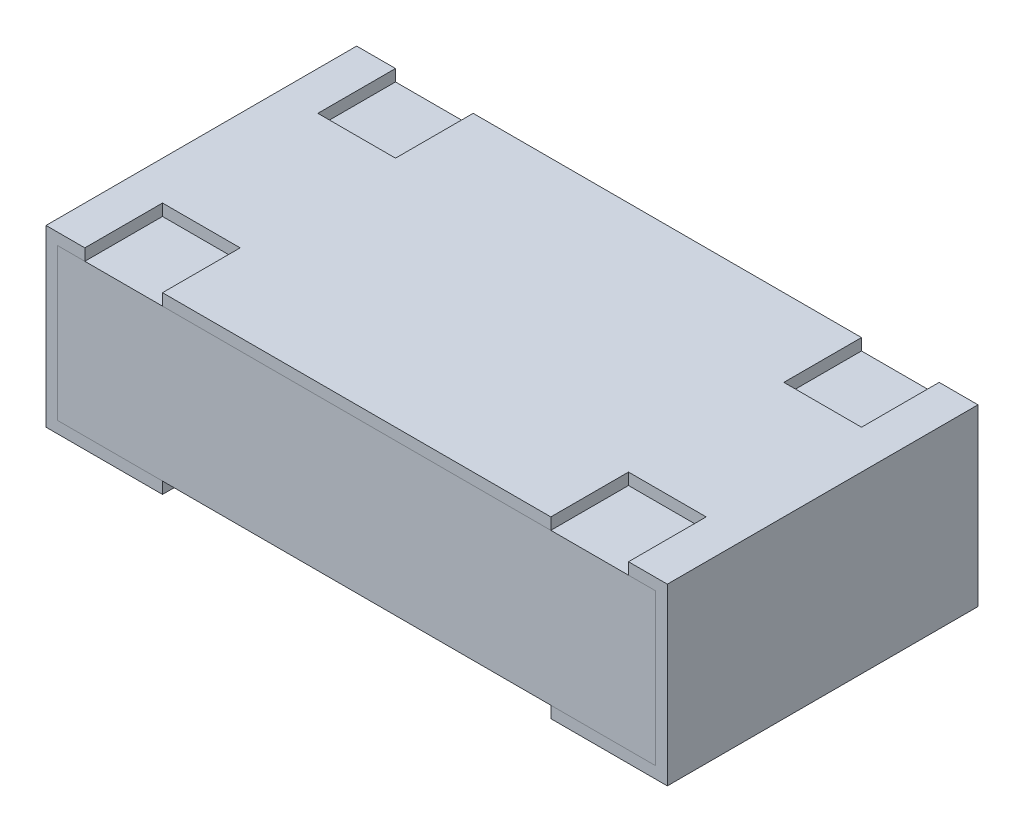
ISO-10303-21;
HEADER;
FILE_DESCRIPTION(('STEP AP214'),'2;1');
FILE_NAME('part.step','',(''),(''),'','','');
FILE_SCHEMA(('AUTOMOTIVE_DESIGN { 1 0 10303 214 1 1 1 1 }'));
ENDSEC;
DATA;
#1=APPLICATION_CONTEXT('core data for automotive mechanical design processes');
#2=APPLICATION_PROTOCOL_DEFINITION('international standard','automotive_design',2000,#1);
#3=PRODUCT_CONTEXT('',#1,'mechanical');
#4=PRODUCT('Part','Part','',(#3));
#5=PRODUCT_RELATED_PRODUCT_CATEGORY('part','',(#4));
#6=PRODUCT_DEFINITION_FORMATION('','',#4);
#7=PRODUCT_DEFINITION_CONTEXT('part definition',#1,'design');
#8=PRODUCT_DEFINITION('design','',#6,#7);
#9=PRODUCT_DEFINITION_SHAPE('','',#8);
#10=(LENGTH_UNIT() NAMED_UNIT(*) SI_UNIT(.MILLI.,.METRE.));
#11=(NAMED_UNIT(*) PLANE_ANGLE_UNIT() SI_UNIT($,.RADIAN.));
#12=(NAMED_UNIT(*) SI_UNIT($,.STERADIAN.) SOLID_ANGLE_UNIT());
#13=UNCERTAINTY_MEASURE_WITH_UNIT(LENGTH_MEASURE(1.E-05),#10,'distance_accuracy_value','');
#14=(GEOMETRIC_REPRESENTATION_CONTEXT(3) GLOBAL_UNCERTAINTY_ASSIGNED_CONTEXT((#13)) GLOBAL_UNIT_ASSIGNED_CONTEXT((#10,
#11,#12)) REPRESENTATION_CONTEXT('',''));
#15=CARTESIAN_POINT('',(0.,0.,0.));
#16=DIRECTION('',(0.,0.,1.));
#17=DIRECTION('',(1.,0.,0.));
#18=AXIS2_PLACEMENT_3D('',#15,#16,#17);
#19=CARTESIAN_POINT('',(0.77,0.42,0.));
#20=DIRECTION('',(0.,0.,1.));
#21=DIRECTION('',(1.,0.,0.));
#22=AXIS2_PLACEMENT_3D('',#19,#20,#21);
#23=PLANE('',#22);
#24=DIRECTION('',(0.,1.,0.));
#25=VECTOR('',#24,1.);
#26=CARTESIAN_POINT('',(0.77,0.03,0.));
#27=LINE('',#26,#25);
#28=CARTESIAN_POINT('',(0.77,0.03,0.));
#29=VERTEX_POINT('',#28);
#30=CARTESIAN_POINT('',(0.77,0.42,0.));
#31=VERTEX_POINT('',#30);
#32=EDGE_CURVE('P0_E89',#29,#31,#27,.T.);
#33=ORIENTED_EDGE('',*,*,#32,.F.);
#34=DIRECTION('',(1.,0.,0.));
#35=VECTOR('',#34,1.);
#36=CARTESIAN_POINT('',(0.77,0.03,0.));
#37=LINE('',#36,#35);
#38=CARTESIAN_POINT('',(-0.77,0.03,0.));
#39=VERTEX_POINT('',#38);
#40=EDGE_CURVE('P0_E26',#39,#29,#37,.T.);
#41=ORIENTED_EDGE('',*,*,#40,.F.);
#42=DIRECTION('',(0.,-1.,0.));
#43=VECTOR('',#42,1.);
#44=CARTESIAN_POINT('',(-0.77,0.03,0.));
#45=LINE('',#44,#43);
#46=CARTESIAN_POINT('',(-0.77,0.42,0.));
#47=VERTEX_POINT('',#46);
#48=EDGE_CURVE('P0_E74',#47,#39,#45,.T.);
#49=ORIENTED_EDGE('',*,*,#48,.F.);
#50=DIRECTION('',(-1.,0.,0.));
#51=VECTOR('',#50,1.);
#52=CARTESIAN_POINT('',(0.77,0.42,0.));
#53=LINE('',#52,#51);
#54=EDGE_CURVE('P0_E78',#31,#47,#53,.T.);
#55=ORIENTED_EDGE('',*,*,#54,.F.);
#56=EDGE_LOOP('',(#33,#41,#49,#55));
#57=FACE_BOUND('',#56,.T.);
#58=ADVANCED_FACE('P0_F17',(#57),#23,.F.);
#59=CARTESIAN_POINT('',(0.77,0.42,0.8));
#60=DIRECTION('',(0.,0.,1.));
#61=DIRECTION('',(1.,0.,0.));
#62=AXIS2_PLACEMENT_3D('',#59,#60,#61);
#63=PLANE('',#62);
#64=DIRECTION('',(0.,1.,0.));
#65=VECTOR('',#64,1.);
#66=CARTESIAN_POINT('',(0.77,0.03,0.8));
#67=LINE('',#66,#65);
#68=CARTESIAN_POINT('',(0.77,0.03,0.8));
#69=VERTEX_POINT('',#68);
#70=CARTESIAN_POINT('',(0.77,0.42,0.8));
#71=VERTEX_POINT('',#70);
#72=EDGE_CURVE('P0_E69',#69,#71,#67,.T.);
#73=ORIENTED_EDGE('',*,*,#72,.T.);
#74=DIRECTION('',(-1.,0.,0.));
#75=VECTOR('',#74,1.);
#76=CARTESIAN_POINT('',(0.77,0.42,0.8));
#77=LINE('',#76,#75);
#78=CARTESIAN_POINT('',(-0.77,0.42,0.8));
#79=VERTEX_POINT('',#78);
#80=EDGE_CURVE('P0_E65',#71,#79,#77,.T.);
#81=ORIENTED_EDGE('',*,*,#80,.T.);
#82=DIRECTION('',(0.,-1.,0.));
#83=VECTOR('',#82,1.);
#84=CARTESIAN_POINT('',(-0.77,0.03,0.8));
#85=LINE('',#84,#83);
#86=CARTESIAN_POINT('',(-0.77,0.03,0.8));
#87=VERTEX_POINT('',#86);
#88=EDGE_CURVE('P0_E53',#79,#87,#85,.T.);
#89=ORIENTED_EDGE('',*,*,#88,.T.);
#90=DIRECTION('',(1.,0.,0.));
#91=VECTOR('',#90,1.);
#92=CARTESIAN_POINT('',(0.77,0.03,0.8));
#93=LINE('',#92,#91);
#94=EDGE_CURVE('P0_E11',#87,#69,#93,.T.);
#95=ORIENTED_EDGE('',*,*,#94,.T.);
#96=EDGE_LOOP('',(#73,#81,#89,#95));
#97=FACE_BOUND('',#96,.T.);
#98=ADVANCED_FACE('P0_F66',(#97),#63,.T.);
#99=CARTESIAN_POINT('',(0.77,0.03,0.8));
#100=DIRECTION('',(0.,1.,0.));
#101=DIRECTION('',(1.,0.,0.));
#102=AXIS2_PLACEMENT_3D('',#99,#100,#101);
#103=PLANE('',#102);
#104=ORIENTED_EDGE('',*,*,#40,.T.);
#105=DIRECTION('',(0.,0.,-1.));
#106=VECTOR('',#105,1.);
#107=CARTESIAN_POINT('',(0.77,0.03,0.8));
#108=LINE('',#107,#106);
#109=EDGE_CURVE('P0_E85',#69,#29,#108,.T.);
#110=ORIENTED_EDGE('',*,*,#109,.F.);
#111=ORIENTED_EDGE('',*,*,#94,.F.);
#112=DIRECTION('',(0.,0.,-1.));
#113=VECTOR('',#112,1.);
#114=CARTESIAN_POINT('',(-0.77,0.03,0.8));
#115=LINE('',#114,#113);
#116=EDGE_CURVE('P0_E60',#87,#39,#115,.T.);
#117=ORIENTED_EDGE('',*,*,#116,.T.);
#118=EDGE_LOOP('',(#104,#110,#111,#117));
#119=FACE_BOUND('',#118,.T.);
#120=ADVANCED_FACE('P0_F107',(#119),#103,.F.);
#121=CARTESIAN_POINT('',(-0.77,0.03,0.8));
#122=DIRECTION('',(1.,0.,0.));
#123=DIRECTION('',(0.,1.,0.));
#124=AXIS2_PLACEMENT_3D('',#121,#122,#123);
#125=PLANE('',#124);
#126=ORIENTED_EDGE('',*,*,#48,.T.);
#127=ORIENTED_EDGE('',*,*,#116,.F.);
#128=ORIENTED_EDGE('',*,*,#88,.F.);
#129=DIRECTION('',(0.,0.,-1.));
#130=VECTOR('',#129,1.);
#131=CARTESIAN_POINT('',(-0.77,0.42,0.8));
#132=LINE('',#131,#130);
#133=EDGE_CURVE('P0_E58',#79,#47,#132,.T.);
#134=ORIENTED_EDGE('',*,*,#133,.T.);
#135=EDGE_LOOP('',(#126,#127,#128,#134));
#136=FACE_BOUND('',#135,.T.);
#137=ADVANCED_FACE('P0_F56',(#136),#125,.F.);
#138=CARTESIAN_POINT('',(0.77,0.42,0.8));
#139=DIRECTION('',(0.,-1.,0.));
#140=DIRECTION('',(0.,0.,-1.));
#141=AXIS2_PLACEMENT_3D('',#138,#139,#140);
#142=PLANE('',#141);
#143=ORIENTED_EDGE('',*,*,#54,.T.);
#144=ORIENTED_EDGE('',*,*,#133,.F.);
#145=ORIENTED_EDGE('',*,*,#80,.F.);
#146=DIRECTION('',(0.,0.,-1.));
#147=VECTOR('',#146,1.);
#148=CARTESIAN_POINT('',(0.77,0.42,0.8));
#149=LINE('',#148,#147);
#150=EDGE_CURVE('P0_E92',#71,#31,#149,.T.);
#151=ORIENTED_EDGE('',*,*,#150,.T.);
#152=EDGE_LOOP('',(#143,#144,#145,#151));
#153=FACE_BOUND('',#152,.T.);
#154=ADVANCED_FACE('P0_F76',(#153),#142,.F.);
#155=CARTESIAN_POINT('',(0.77,0.03,0.8));
#156=DIRECTION('',(-1.,0.,0.));
#157=DIRECTION('',(0.,0.,1.));
#158=AXIS2_PLACEMENT_3D('',#155,#156,#157);
#159=PLANE('',#158);
#160=ORIENTED_EDGE('',*,*,#32,.T.);
#161=ORIENTED_EDGE('',*,*,#150,.F.);
#162=ORIENTED_EDGE('',*,*,#72,.F.);
#163=ORIENTED_EDGE('',*,*,#109,.T.);
#164=EDGE_LOOP('',(#160,#161,#162,#163));
#165=FACE_BOUND('',#164,.T.);
#166=ADVANCED_FACE('P0_F129',(#165),#159,.F.);
#167=CLOSED_SHELL('',(#58,#98,#120,#137,#154,#166));
#168=MANIFOLD_SOLID_BREP('P0_B1',#167);
#169=CARTESIAN_POINT('',(0.7,0.42,0.6));
#170=DIRECTION('',(1.,0.,0.));
#171=DIRECTION('',(0.,1.,0.));
#172=AXIS2_PLACEMENT_3D('',#169,#170,#171);
#173=PLANE('',#172);
#174=DIRECTION('',(0.,0.,-1.));
#175=VECTOR('',#174,1.);
#176=CARTESIAN_POINT('',(0.7,0.45,0.6));
#177=LINE('',#176,#175);
#178=CARTESIAN_POINT('',(0.7,0.45,0.8));
#179=VERTEX_POINT('',#178);
#180=CARTESIAN_POINT('',(0.7,0.45,0.6));
#181=VERTEX_POINT('',#180);
#182=EDGE_CURVE('P1_E459',#179,#181,#177,.T.);
#183=ORIENTED_EDGE('',*,*,#182,.T.);
#184=DIRECTION('',(0.,1.,0.));
#185=VECTOR('',#184,1.);
#186=CARTESIAN_POINT('',(0.7,0.42,0.6));
#187=LINE('',#186,#185);
#188=CARTESIAN_POINT('',(0.7,0.42,0.6));
#189=VERTEX_POINT('',#188);
#190=EDGE_CURVE('P1_E11',#189,#181,#187,.T.);
#191=ORIENTED_EDGE('',*,*,#190,.F.);
#192=DIRECTION('',(0.,0.,-1.));
#193=VECTOR('',#192,1.);
#194=CARTESIAN_POINT('',(0.7,0.42,0.6));
#195=LINE('',#194,#193);
#196=CARTESIAN_POINT('',(0.7,0.42,0.8));
#197=VERTEX_POINT('',#196);
#198=EDGE_CURVE('P1_E253',#197,#189,#195,.T.);
#199=ORIENTED_EDGE('',*,*,#198,.F.);
#200=DIRECTION('',(0.,1.,0.));
#201=VECTOR('',#200,1.);
#202=CARTESIAN_POINT('',(0.7,0.42,0.8));
#203=LINE('',#202,#201);
#204=EDGE_CURVE('P1_E40',#197,#179,#203,.T.);
#205=ORIENTED_EDGE('',*,*,#204,.T.);
#206=EDGE_LOOP('',(#183,#191,#199,#205));
#207=FACE_BOUND('',#206,.T.);
#208=ADVANCED_FACE('P1_F17',(#207),#173,.F.);
#209=CARTESIAN_POINT('',(0.5,0.42,0.6));
#210=DIRECTION('',(0.,0.,-1.));
#211=DIRECTION('',(0.,-1.,0.));
#212=AXIS2_PLACEMENT_3D('',#209,#210,#211);
#213=PLANE('',#212);
#214=DIRECTION('',(-1.,0.,0.));
#215=VECTOR('',#214,1.);
#216=CARTESIAN_POINT('',(0.5,0.45,0.6));
#217=LINE('',#216,#215);
#218=CARTESIAN_POINT('',(0.5,0.45,0.6));
#219=VERTEX_POINT('',#218);
#220=EDGE_CURVE('P1_E233',#181,#219,#217,.T.);
#221=ORIENTED_EDGE('',*,*,#220,.T.);
#222=DIRECTION('',(0.,1.,0.));
#223=VECTOR('',#222,1.);
#224=CARTESIAN_POINT('',(0.5,0.42,0.6));
#225=LINE('',#224,#223);
#226=CARTESIAN_POINT('',(0.5,0.42,0.6));
#227=VERTEX_POINT('',#226);
#228=EDGE_CURVE('P1_E20',#227,#219,#225,.T.);
#229=ORIENTED_EDGE('',*,*,#228,.F.);
#230=DIRECTION('',(-1.,0.,0.));
#231=VECTOR('',#230,1.);
#232=CARTESIAN_POINT('',(0.5,0.42,0.6));
#233=LINE('',#232,#231);
#234=EDGE_CURVE('P1_E230',#189,#227,#233,.T.);
#235=ORIENTED_EDGE('',*,*,#234,.F.);
#236=ORIENTED_EDGE('',*,*,#190,.T.);
#237=EDGE_LOOP('',(#221,#229,#235,#236));
#238=FACE_BOUND('',#237,.T.);
#239=ADVANCED_FACE('P1_F228',(#238),#213,.F.);
#240=CARTESIAN_POINT('',(0.5,0.42,0.8));
#241=DIRECTION('',(-1.,0.,0.));
#242=DIRECTION('',(0.,0.,1.));
#243=AXIS2_PLACEMENT_3D('',#240,#241,#242);
#244=PLANE('',#243);
#245=DIRECTION('',(0.,0.,1.));
#246=VECTOR('',#245,1.);
#247=CARTESIAN_POINT('',(0.5,0.45,0.8));
#248=LINE('',#247,#246);
#249=CARTESIAN_POINT('',(0.5,0.45,0.8));
#250=VERTEX_POINT('',#249);
#251=EDGE_CURVE('P1_E286',#219,#250,#248,.T.);
#252=ORIENTED_EDGE('',*,*,#251,.T.);
#253=DIRECTION('',(0.,1.,0.));
#254=VECTOR('',#253,1.);
#255=CARTESIAN_POINT('',(0.5,0.42,0.8));
#256=LINE('',#255,#254);
#257=CARTESIAN_POINT('',(0.5,0.42,0.8));
#258=VERTEX_POINT('',#257);
#259=EDGE_CURVE('P1_E243',#258,#250,#256,.T.);
#260=ORIENTED_EDGE('',*,*,#259,.F.);
#261=DIRECTION('',(0.,0.,1.));
#262=VECTOR('',#261,1.);
#263=CARTESIAN_POINT('',(0.5,0.42,0.8));
#264=LINE('',#263,#262);
#265=EDGE_CURVE('P1_E240',#227,#258,#264,.T.);
#266=ORIENTED_EDGE('',*,*,#265,.F.);
#267=ORIENTED_EDGE('',*,*,#228,.T.);
#268=EDGE_LOOP('',(#252,#260,#266,#267));
#269=FACE_BOUND('',#268,.T.);
#270=ADVANCED_FACE('P1_F241',(#269),#244,.F.);
#271=CARTESIAN_POINT('',(-0.5,0.42,0.8));
#272=DIRECTION('',(1.,0.,0.));
#273=DIRECTION('',(0.,1.,0.));
#274=AXIS2_PLACEMENT_3D('',#271,#272,#273);
#275=PLANE('',#274);
#276=DIRECTION('',(0.,0.,-1.));
#277=VECTOR('',#276,1.);
#278=CARTESIAN_POINT('',(-0.5,0.45,0.8));
#279=LINE('',#278,#277);
#280=CARTESIAN_POINT('',(-0.5,0.45,0.8));
#281=VERTEX_POINT('',#280);
#282=CARTESIAN_POINT('',(-0.5,0.45,0.6));
#283=VERTEX_POINT('',#282);
#284=EDGE_CURVE('P1_E287',#281,#283,#279,.T.);
#285=ORIENTED_EDGE('',*,*,#284,.T.);
#286=DIRECTION('',(0.,1.,0.));
#287=VECTOR('',#286,1.);
#288=CARTESIAN_POINT('',(-0.5,0.42,0.6));
#289=LINE('',#288,#287);
#290=CARTESIAN_POINT('',(-0.5,0.42,0.6));
#291=VERTEX_POINT('',#290);
#292=EDGE_CURVE('P1_E238',#291,#283,#289,.T.);
#293=ORIENTED_EDGE('',*,*,#292,.F.);
#294=DIRECTION('',(0.,0.,-1.));
#295=VECTOR('',#294,1.);
#296=CARTESIAN_POINT('',(-0.5,0.42,0.8));
#297=LINE('',#296,#295);
#298=CARTESIAN_POINT('',(-0.5,0.42,0.8));
#299=VERTEX_POINT('',#298);
#300=EDGE_CURVE('P1_E248',#299,#291,#297,.T.);
#301=ORIENTED_EDGE('',*,*,#300,.F.);
#302=DIRECTION('',(0.,1.,0.));
#303=VECTOR('',#302,1.);
#304=CARTESIAN_POINT('',(-0.5,0.42,0.8));
#305=LINE('',#304,#303);
#306=EDGE_CURVE('P1_E344',#299,#281,#305,.T.);
#307=ORIENTED_EDGE('',*,*,#306,.T.);
#308=EDGE_LOOP('',(#285,#293,#301,#307));
#309=FACE_BOUND('',#308,.T.);
#310=ADVANCED_FACE('P1_F505',(#309),#275,.F.);
#311=CARTESIAN_POINT('',(-0.5,0.42,0.6));
#312=DIRECTION('',(0.,0.,-1.));
#313=DIRECTION('',(0.,-1.,0.));
#314=AXIS2_PLACEMENT_3D('',#311,#312,#313);
#315=PLANE('',#314);
#316=DIRECTION('',(-1.,0.,0.));
#317=VECTOR('',#316,1.);
#318=CARTESIAN_POINT('',(-0.5,0.45,0.6));
#319=LINE('',#318,#317);
#320=CARTESIAN_POINT('',(-0.7,0.45,0.6));
#321=VERTEX_POINT('',#320);
#322=EDGE_CURVE('P1_E316',#283,#321,#319,.T.);
#323=ORIENTED_EDGE('',*,*,#322,.T.);
#324=DIRECTION('',(0.,1.,0.));
#325=VECTOR('',#324,1.);
#326=CARTESIAN_POINT('',(-0.7,0.42,0.6));
#327=LINE('',#326,#325);
#328=CARTESIAN_POINT('',(-0.7,0.42,0.6));
#329=VERTEX_POINT('',#328);
#330=EDGE_CURVE('P1_E483',#329,#321,#327,.T.);
#331=ORIENTED_EDGE('',*,*,#330,.F.);
#332=DIRECTION('',(-1.,0.,0.));
#333=VECTOR('',#332,1.);
#334=CARTESIAN_POINT('',(-0.5,0.42,0.6));
#335=LINE('',#334,#333);
#336=EDGE_CURVE('P1_E315',#291,#329,#335,.T.);
#337=ORIENTED_EDGE('',*,*,#336,.F.);
#338=ORIENTED_EDGE('',*,*,#292,.T.);
#339=EDGE_LOOP('',(#323,#331,#337,#338));
#340=FACE_BOUND('',#339,.T.);
#341=ADVANCED_FACE('P1_F491',(#340),#315,.F.);
#342=CARTESIAN_POINT('',(-0.7,0.42,0.6));
#343=DIRECTION('',(-1.,0.,0.));
#344=DIRECTION('',(0.,0.,1.));
#345=AXIS2_PLACEMENT_3D('',#342,#343,#344);
#346=PLANE('',#345);
#347=DIRECTION('',(0.,0.,1.));
#348=VECTOR('',#347,1.);
#349=CARTESIAN_POINT('',(-0.7,0.45,0.6));
#350=LINE('',#349,#348);
#351=CARTESIAN_POINT('',(-0.7,0.45,0.8));
#352=VERTEX_POINT('',#351);
#353=EDGE_CURVE('P1_E310',#321,#352,#350,.T.);
#354=ORIENTED_EDGE('',*,*,#353,.T.);
#355=DIRECTION('',(0.,1.,0.));
#356=VECTOR('',#355,1.);
#357=CARTESIAN_POINT('',(-0.7,0.42,0.8));
#358=LINE('',#357,#356);
#359=CARTESIAN_POINT('',(-0.7,0.42,0.8));
#360=VERTEX_POINT('',#359);
#361=EDGE_CURVE('P1_E348',#360,#352,#358,.T.);
#362=ORIENTED_EDGE('',*,*,#361,.F.);
#363=DIRECTION('',(0.,0.,1.));
#364=VECTOR('',#363,1.);
#365=CARTESIAN_POINT('',(-0.7,0.42,0.6));
#366=LINE('',#365,#364);
#367=EDGE_CURVE('P1_E311',#329,#360,#366,.T.);
#368=ORIENTED_EDGE('',*,*,#367,.F.);
#369=ORIENTED_EDGE('',*,*,#330,.T.);
#370=EDGE_LOOP('',(#354,#362,#368,#369));
#371=FACE_BOUND('',#370,.T.);
#372=ADVANCED_FACE('P1_F635',(#371),#346,.F.);
#373=CARTESIAN_POINT('',(-0.7,0.42,0.2));
#374=DIRECTION('',(-1.,0.,0.));
#375=DIRECTION('',(0.,0.,1.));
#376=AXIS2_PLACEMENT_3D('',#373,#374,#375);
#377=PLANE('',#376);
#378=DIRECTION('',(0.,0.,1.));
#379=VECTOR('',#378,1.);
#380=CARTESIAN_POINT('',(-0.7,0.45,0.2));
#381=LINE('',#380,#379);
#382=CARTESIAN_POINT('',(-0.7,0.45,0.));
#383=VERTEX_POINT('',#382);
#384=CARTESIAN_POINT('',(-0.7,0.45,0.2));
#385=VERTEX_POINT('',#384);
#386=EDGE_CURVE('P1_E300',#383,#385,#381,.T.);
#387=ORIENTED_EDGE('',*,*,#386,.T.);
#388=DIRECTION('',(0.,1.,0.));
#389=VECTOR('',#388,1.);
#390=CARTESIAN_POINT('',(-0.7,0.42,0.2));
#391=LINE('',#390,#389);
#392=CARTESIAN_POINT('',(-0.7,0.42,0.2));
#393=VERTEX_POINT('',#392);
#394=EDGE_CURVE('P1_E480',#393,#385,#391,.T.);
#395=ORIENTED_EDGE('',*,*,#394,.F.);
#396=DIRECTION('',(0.,0.,1.));
#397=VECTOR('',#396,1.);
#398=CARTESIAN_POINT('',(-0.7,0.42,0.2));
#399=LINE('',#398,#397);
#400=CARTESIAN_POINT('',(-0.7,0.42,0.));
#401=VERTEX_POINT('',#400);
#402=EDGE_CURVE('P1_E367',#401,#393,#399,.T.);
#403=ORIENTED_EDGE('',*,*,#402,.F.);
#404=DIRECTION('',(0.,1.,0.));
#405=VECTOR('',#404,1.);
#406=CARTESIAN_POINT('',(-0.7,0.42,0.));
#407=LINE('',#406,#405);
#408=EDGE_CURVE('P1_E470',#401,#383,#407,.T.);
#409=ORIENTED_EDGE('',*,*,#408,.T.);
#410=EDGE_LOOP('',(#387,#395,#403,#409));
#411=FACE_BOUND('',#410,.T.);
#412=ADVANCED_FACE('P1_F646',(#411),#377,.F.);
#413=CARTESIAN_POINT('',(-0.5,0.42,0.2));
#414=DIRECTION('',(0.,0.,1.));
#415=DIRECTION('',(1.,0.,0.));
#416=AXIS2_PLACEMENT_3D('',#413,#414,#415);
#417=PLANE('',#416);
#418=DIRECTION('',(1.,0.,0.));
#419=VECTOR('',#418,1.);
#420=CARTESIAN_POINT('',(-0.5,0.45,0.2));
#421=LINE('',#420,#419);
#422=CARTESIAN_POINT('',(-0.5,0.45,0.2));
#423=VERTEX_POINT('',#422);
#424=EDGE_CURVE('P1_E290',#385,#423,#421,.T.);
#425=ORIENTED_EDGE('',*,*,#424,.T.);
#426=DIRECTION('',(0.,1.,0.));
#427=VECTOR('',#426,1.);
#428=CARTESIAN_POINT('',(-0.5,0.42,0.2));
#429=LINE('',#428,#427);
#430=CARTESIAN_POINT('',(-0.5,0.42,0.2));
#431=VERTEX_POINT('',#430);
#432=EDGE_CURVE('P1_E476',#431,#423,#429,.T.);
#433=ORIENTED_EDGE('',*,*,#432,.F.);
#434=DIRECTION('',(1.,0.,0.));
#435=VECTOR('',#434,1.);
#436=CARTESIAN_POINT('',(-0.5,0.42,0.2));
#437=LINE('',#436,#435);
#438=EDGE_CURVE('P1_E419',#393,#431,#437,.T.);
#439=ORIENTED_EDGE('',*,*,#438,.F.);
#440=ORIENTED_EDGE('',*,*,#394,.T.);
#441=EDGE_LOOP('',(#425,#433,#439,#440));
#442=FACE_BOUND('',#441,.T.);
#443=ADVANCED_FACE('P1_F655',(#442),#417,.F.);
#444=CARTESIAN_POINT('',(-0.5,0.42,0.));
#445=DIRECTION('',(1.,0.,0.));
#446=DIRECTION('',(0.,1.,0.));
#447=AXIS2_PLACEMENT_3D('',#444,#445,#446);
#448=PLANE('',#447);
#449=DIRECTION('',(0.,0.,-1.));
#450=VECTOR('',#449,1.);
#451=CARTESIAN_POINT('',(-0.5,0.45,0.));
#452=LINE('',#451,#450);
#453=CARTESIAN_POINT('',(-0.5,0.45,0.));
#454=VERTEX_POINT('',#453);
#455=EDGE_CURVE('P1_E508',#423,#454,#452,.T.);
#456=ORIENTED_EDGE('',*,*,#455,.T.);
#457=DIRECTION('',(0.,1.,0.));
#458=VECTOR('',#457,1.);
#459=CARTESIAN_POINT('',(-0.5,0.42,0.));
#460=LINE('',#459,#458);
#461=CARTESIAN_POINT('',(-0.5,0.42,0.));
#462=VERTEX_POINT('',#461);
#463=EDGE_CURVE('P1_E323',#462,#454,#460,.T.);
#464=ORIENTED_EDGE('',*,*,#463,.F.);
#465=DIRECTION('',(0.,0.,-1.));
#466=VECTOR('',#465,1.);
#467=CARTESIAN_POINT('',(-0.5,0.42,0.));
#468=LINE('',#467,#466);
#469=EDGE_CURVE('P1_E354',#431,#462,#468,.T.);
#470=ORIENTED_EDGE('',*,*,#469,.F.);
#471=ORIENTED_EDGE('',*,*,#432,.T.);
#472=EDGE_LOOP('',(#456,#464,#470,#471));
#473=FACE_BOUND('',#472,.T.);
#474=ADVANCED_FACE('P1_F660',(#473),#448,.F.);
#475=CARTESIAN_POINT('',(0.5,0.42,0.));
#476=DIRECTION('',(-1.,0.,0.));
#477=DIRECTION('',(0.,0.,1.));
#478=AXIS2_PLACEMENT_3D('',#475,#476,#477);
#479=PLANE('',#478);
#480=DIRECTION('',(0.,0.,1.));
#481=VECTOR('',#480,1.);
#482=CARTESIAN_POINT('',(0.5,0.45,0.));
#483=LINE('',#482,#481);
#484=CARTESIAN_POINT('',(0.5,0.45,0.));
#485=VERTEX_POINT('',#484);
#486=CARTESIAN_POINT('',(0.5,0.45,0.2));
#487=VERTEX_POINT('',#486);
#488=EDGE_CURVE('P1_E271',#485,#487,#483,.T.);
#489=ORIENTED_EDGE('',*,*,#488,.T.);
#490=DIRECTION('',(0.,1.,0.));
#491=VECTOR('',#490,1.);
#492=CARTESIAN_POINT('',(0.5,0.42,0.2));
#493=LINE('',#492,#491);
#494=CARTESIAN_POINT('',(0.5,0.42,0.2));
#495=VERTEX_POINT('',#494);
#496=EDGE_CURVE('P1_E475',#495,#487,#493,.T.);
#497=ORIENTED_EDGE('',*,*,#496,.F.);
#498=DIRECTION('',(0.,0.,1.));
#499=VECTOR('',#498,1.);
#500=CARTESIAN_POINT('',(0.5,0.42,0.));
#501=LINE('',#500,#499);
#502=CARTESIAN_POINT('',(0.5,0.42,0.));
#503=VERTEX_POINT('',#502);
#504=EDGE_CURVE('P1_E349',#503,#495,#501,.T.);
#505=ORIENTED_EDGE('',*,*,#504,.F.);
#506=DIRECTION('',(0.,1.,0.));
#507=VECTOR('',#506,1.);
#508=CARTESIAN_POINT('',(0.5,0.42,0.));
#509=LINE('',#508,#507);
#510=EDGE_CURVE('P1_E320',#503,#485,#509,.T.);
#511=ORIENTED_EDGE('',*,*,#510,.T.);
#512=EDGE_LOOP('',(#489,#497,#505,#511));
#513=FACE_BOUND('',#512,.T.);
#514=ADVANCED_FACE('P1_F672',(#513),#479,.F.);
#515=CARTESIAN_POINT('',(0.5,0.42,0.2));
#516=DIRECTION('',(0.,0.,1.));
#517=DIRECTION('',(1.,0.,0.));
#518=AXIS2_PLACEMENT_3D('',#515,#516,#517);
#519=PLANE('',#518);
#520=DIRECTION('',(1.,0.,0.));
#521=VECTOR('',#520,1.);
#522=CARTESIAN_POINT('',(0.5,0.45,0.2));
#523=LINE('',#522,#521);
#524=CARTESIAN_POINT('',(0.7,0.45,0.2));
#525=VERTEX_POINT('',#524);
#526=EDGE_CURVE('P1_E453',#487,#525,#523,.T.);
#527=ORIENTED_EDGE('',*,*,#526,.T.);
#528=DIRECTION('',(0.,1.,0.));
#529=VECTOR('',#528,1.);
#530=CARTESIAN_POINT('',(0.7,0.42,0.2));
#531=LINE('',#530,#529);
#532=CARTESIAN_POINT('',(0.7,0.42,0.2));
#533=VERTEX_POINT('',#532);
#534=EDGE_CURVE('P1_E471',#533,#525,#531,.T.);
#535=ORIENTED_EDGE('',*,*,#534,.F.);
#536=DIRECTION('',(1.,0.,0.));
#537=VECTOR('',#536,1.);
#538=CARTESIAN_POINT('',(0.5,0.42,0.2));
#539=LINE('',#538,#537);
#540=EDGE_CURVE('P1_E353',#495,#533,#539,.T.);
#541=ORIENTED_EDGE('',*,*,#540,.F.);
#542=ORIENTED_EDGE('',*,*,#496,.T.);
#543=EDGE_LOOP('',(#527,#535,#541,#542));
#544=FACE_BOUND('',#543,.T.);
#545=ADVANCED_FACE('P1_F684',(#544),#519,.F.);
#546=CARTESIAN_POINT('',(0.7,0.42,0.2));
#547=DIRECTION('',(1.,0.,0.));
#548=DIRECTION('',(0.,1.,0.));
#549=AXIS2_PLACEMENT_3D('',#546,#547,#548);
#550=PLANE('',#549);
#551=DIRECTION('',(0.,0.,-1.));
#552=VECTOR('',#551,1.);
#553=CARTESIAN_POINT('',(0.7,0.45,0.2));
#554=LINE('',#553,#552);
#555=CARTESIAN_POINT('',(0.7,0.45,0.));
#556=VERTEX_POINT('',#555);
#557=EDGE_CURVE('P1_E465',#525,#556,#554,.T.);
#558=ORIENTED_EDGE('',*,*,#557,.T.);
#559=DIRECTION('',(0.,1.,0.));
#560=VECTOR('',#559,1.);
#561=CARTESIAN_POINT('',(0.7,0.42,0.));
#562=LINE('',#561,#560);
#563=CARTESIAN_POINT('',(0.7,0.42,0.));
#564=VERTEX_POINT('',#563);
#565=EDGE_CURVE('P1_E291',#564,#556,#562,.T.);
#566=ORIENTED_EDGE('',*,*,#565,.F.);
#567=DIRECTION('',(0.,0.,-1.));
#568=VECTOR('',#567,1.);
#569=CARTESIAN_POINT('',(0.7,0.42,0.2));
#570=LINE('',#569,#568);
#571=EDGE_CURVE('P1_E422',#533,#564,#570,.T.);
#572=ORIENTED_EDGE('',*,*,#571,.F.);
#573=ORIENTED_EDGE('',*,*,#534,.T.);
#574=EDGE_LOOP('',(#558,#566,#572,#573));
#575=FACE_BOUND('',#574,.T.);
#576=ADVANCED_FACE('P1_F696',(#575),#550,.F.);
#577=CARTESIAN_POINT('',(-0.8,0.45,0.));
#578=DIRECTION('',(0.,0.,1.));
#579=DIRECTION('',(1.,0.,0.));
#580=AXIS2_PLACEMENT_3D('',#577,#578,#579);
#581=PLANE('',#580);
#582=DIRECTION('',(-1.,0.,0.));
#583=VECTOR('',#582,1.);
#584=CARTESIAN_POINT('',(0.,0.45,0.));
#585=LINE('',#584,#583);
#586=CARTESIAN_POINT('',(-0.8,0.45,0.));
#587=VERTEX_POINT('',#586);
#588=EDGE_CURVE('P1_E281',#383,#587,#585,.T.);
#589=ORIENTED_EDGE('',*,*,#588,.F.);
#590=ORIENTED_EDGE('',*,*,#408,.F.);
#591=DIRECTION('',(1.,0.,0.));
#592=VECTOR('',#591,1.);
#593=CARTESIAN_POINT('',(0.,0.42,0.));
#594=LINE('',#593,#592);
#595=CARTESIAN_POINT('',(-0.77,0.42,0.));
#596=VERTEX_POINT('',#595);
#597=EDGE_CURVE('P1_E314',#596,#401,#594,.T.);
#598=ORIENTED_EDGE('',*,*,#597,.F.);
#599=DIRECTION('',(0.,1.,0.));
#600=VECTOR('',#599,1.);
#601=CARTESIAN_POINT('',(-0.77,0.42,0.));
#602=LINE('',#601,#600);
#603=CARTESIAN_POINT('',(-0.77,0.03,0.));
#604=VERTEX_POINT('',#603);
#605=EDGE_CURVE('P1_E414',#604,#596,#602,.T.);
#606=ORIENTED_EDGE('',*,*,#605,.F.);
#607=DIRECTION('',(-1.,0.,0.));
#608=VECTOR('',#607,1.);
#609=CARTESIAN_POINT('',(-0.77,0.03,0.));
#610=LINE('',#609,#608);
#611=CARTESIAN_POINT('',(-0.5,0.03,0.));
#612=VERTEX_POINT('',#611);
#613=EDGE_CURVE('P1_E409',#612,#604,#610,.T.);
#614=ORIENTED_EDGE('',*,*,#613,.F.);
#615=DIRECTION('',(0.,1.,0.));
#616=VECTOR('',#615,1.);
#617=CARTESIAN_POINT('',(-0.5,0.03,0.));
#618=LINE('',#617,#616);
#619=CARTESIAN_POINT('',(-0.5,0.,0.));
#620=VERTEX_POINT('',#619);
#621=EDGE_CURVE('P1_E340',#620,#612,#618,.T.);
#622=ORIENTED_EDGE('',*,*,#621,.F.);
#623=DIRECTION('',(1.,0.,0.));
#624=VECTOR('',#623,1.);
#625=CARTESIAN_POINT('',(-0.8,0.,0.));
#626=LINE('',#625,#624);
#627=CARTESIAN_POINT('',(-0.8,0.,0.));
#628=VERTEX_POINT('',#627);
#629=EDGE_CURVE('P1_E341',#628,#620,#626,.T.);
#630=ORIENTED_EDGE('',*,*,#629,.F.);
#631=DIRECTION('',(0.,-1.,0.));
#632=VECTOR('',#631,1.);
#633=CARTESIAN_POINT('',(-0.8,0.45,0.));
#634=LINE('',#633,#632);
#635=EDGE_CURVE('P1_E398',#587,#628,#634,.T.);
#636=ORIENTED_EDGE('',*,*,#635,.F.);
#637=EDGE_LOOP('',(#589,#590,#598,#606,#614,#622,#630,#636));
#638=FACE_BOUND('',#637,.T.);
#639=ADVANCED_FACE('P1_F705',(#638),#581,.F.);
#640=CARTESIAN_POINT('',(-0.8,0.45,0.8));
#641=DIRECTION('',(0.,0.,1.));
#642=DIRECTION('',(1.,0.,0.));
#643=AXIS2_PLACEMENT_3D('',#640,#641,#642);
#644=PLANE('',#643);
#645=ORIENTED_EDGE('',*,*,#204,.F.);
#646=DIRECTION('',(1.,0.,0.));
#647=VECTOR('',#646,1.);
#648=CARTESIAN_POINT('',(0.,0.42,0.8));
#649=LINE('',#648,#647);
#650=CARTESIAN_POINT('',(0.77,0.42,0.8));
#651=VERTEX_POINT('',#650);
#652=EDGE_CURVE('P1_E260',#197,#651,#649,.T.);
#653=ORIENTED_EDGE('',*,*,#652,.T.);
#654=DIRECTION('',(0.,-1.,0.));
#655=VECTOR('',#654,1.);
#656=CARTESIAN_POINT('',(0.77,0.42,0.8));
#657=LINE('',#656,#655);
#658=CARTESIAN_POINT('',(0.77,0.03,0.8));
#659=VERTEX_POINT('',#658);
#660=EDGE_CURVE('P1_E430',#651,#659,#657,.T.);
#661=ORIENTED_EDGE('',*,*,#660,.T.);
#662=DIRECTION('',(-1.,0.,0.));
#663=VECTOR('',#662,1.);
#664=CARTESIAN_POINT('',(0.77,0.03,0.8));
#665=LINE('',#664,#663);
#666=CARTESIAN_POINT('',(0.5,0.03,0.8));
#667=VERTEX_POINT('',#666);
#668=EDGE_CURVE('P1_E383',#659,#667,#665,.T.);
#669=ORIENTED_EDGE('',*,*,#668,.T.);
#670=DIRECTION('',(0.,-1.,0.));
#671=VECTOR('',#670,1.);
#672=CARTESIAN_POINT('',(0.5,0.03,0.8));
#673=LINE('',#672,#671);
#674=CARTESIAN_POINT('',(0.5,0.,0.8));
#675=VERTEX_POINT('',#674);
#676=EDGE_CURVE('P1_E270',#667,#675,#673,.T.);
#677=ORIENTED_EDGE('',*,*,#676,.T.);
#678=DIRECTION('',(1.,0.,0.));
#679=VECTOR('',#678,1.);
#680=CARTESIAN_POINT('',(0.8,0.,0.8));
#681=LINE('',#680,#679);
#682=CARTESIAN_POINT('',(0.8,0.,0.8));
#683=VERTEX_POINT('',#682);
#684=EDGE_CURVE('P1_E269',#675,#683,#681,.T.);
#685=ORIENTED_EDGE('',*,*,#684,.T.);
#686=DIRECTION('',(0.,1.,0.));
#687=VECTOR('',#686,1.);
#688=CARTESIAN_POINT('',(0.8,0.45,0.8));
#689=LINE('',#688,#687);
#690=CARTESIAN_POINT('',(0.8,0.45,0.8));
#691=VERTEX_POINT('',#690);
#692=EDGE_CURVE('P1_E449',#683,#691,#689,.T.);
#693=ORIENTED_EDGE('',*,*,#692,.T.);
#694=DIRECTION('',(-1.,0.,0.));
#695=VECTOR('',#694,1.);
#696=CARTESIAN_POINT('',(0.,0.45,0.8));
#697=LINE('',#696,#695);
#698=EDGE_CURVE('P1_E462',#691,#179,#697,.T.);
#699=ORIENTED_EDGE('',*,*,#698,.T.);
#700=EDGE_LOOP('',(#645,#653,#661,#669,#677,#685,#693,#699));
#701=FACE_BOUND('',#700,.T.);
#702=ADVANCED_FACE('P1_F551',(#701),#644,.T.);
#703=CARTESIAN_POINT('',(0.8,0.45,0.8));
#704=DIRECTION('',(-1.,0.,0.));
#705=DIRECTION('',(0.,0.,1.));
#706=AXIS2_PLACEMENT_3D('',#703,#704,#705);
#707=PLANE('',#706);
#708=DIRECTION('',(0.,1.,0.));
#709=VECTOR('',#708,1.);
#710=CARTESIAN_POINT('',(0.8,0.45,0.));
#711=LINE('',#710,#709);
#712=CARTESIAN_POINT('',(0.8,0.,0.));
#713=VERTEX_POINT('',#712);
#714=CARTESIAN_POINT('',(0.8,0.45,0.));
#715=VERTEX_POINT('',#714);
#716=EDGE_CURVE('P1_E387',#713,#715,#711,.T.);
#717=ORIENTED_EDGE('',*,*,#716,.T.);
#718=DIRECTION('',(0.,0.,-1.));
#719=VECTOR('',#718,1.);
#720=CARTESIAN_POINT('',(0.8,0.45,0.8));
#721=LINE('',#720,#719);
#722=EDGE_CURVE('P1_E446',#691,#715,#721,.T.);
#723=ORIENTED_EDGE('',*,*,#722,.F.);
#724=ORIENTED_EDGE('',*,*,#692,.F.);
#725=DIRECTION('',(0.,0.,-1.));
#726=VECTOR('',#725,1.);
#727=CARTESIAN_POINT('',(0.8,0.,0.8));
#728=LINE('',#727,#726);
#729=EDGE_CURVE('P1_E266',#683,#713,#728,.T.);
#730=ORIENTED_EDGE('',*,*,#729,.T.);
#731=EDGE_LOOP('',(#717,#723,#724,#730));
#732=FACE_BOUND('',#731,.T.);
#733=ADVANCED_FACE('P1_F539',(#732),#707,.F.);
#734=CARTESIAN_POINT('',(0.8,0.,0.8));
#735=DIRECTION('',(0.,1.,0.));
#736=DIRECTION('',(1.,0.,0.));
#737=AXIS2_PLACEMENT_3D('',#734,#735,#736);
#738=PLANE('',#737);
#739=DIRECTION('',(1.,0.,0.));
#740=VECTOR('',#739,1.);
#741=CARTESIAN_POINT('',(0.8,0.,0.));
#742=LINE('',#741,#740);
#743=CARTESIAN_POINT('',(0.5,0.,0.));
#744=VERTEX_POINT('',#743);
#745=EDGE_CURVE('P1_E329',#744,#713,#742,.T.);
#746=ORIENTED_EDGE('',*,*,#745,.T.);
#747=ORIENTED_EDGE('',*,*,#729,.F.);
#748=ORIENTED_EDGE('',*,*,#684,.F.);
#749=DIRECTION('',(0.,0.,-1.));
#750=VECTOR('',#749,1.);
#751=CARTESIAN_POINT('',(0.5,0.,0.8));
#752=LINE('',#751,#750);
#753=EDGE_CURVE('P1_E380',#675,#744,#752,.T.);
#754=ORIENTED_EDGE('',*,*,#753,.T.);
#755=EDGE_LOOP('',(#746,#747,#748,#754));
#756=FACE_BOUND('',#755,.T.);
#757=ADVANCED_FACE('P1_F722',(#756),#738,.F.);
#758=CARTESIAN_POINT('',(0.5,0.03,0.8));
#759=DIRECTION('',(1.,0.,0.));
#760=DIRECTION('',(0.,1.,0.));
#761=AXIS2_PLACEMENT_3D('',#758,#759,#760);
#762=PLANE('',#761);
#763=DIRECTION('',(0.,-1.,0.));
#764=VECTOR('',#763,1.);
#765=CARTESIAN_POINT('',(0.5,0.03,0.));
#766=LINE('',#765,#764);
#767=CARTESIAN_POINT('',(0.5,0.03,0.));
#768=VERTEX_POINT('',#767);
#769=EDGE_CURVE('P1_E324',#768,#744,#766,.T.);
#770=ORIENTED_EDGE('',*,*,#769,.T.);
#771=ORIENTED_EDGE('',*,*,#753,.F.);
#772=ORIENTED_EDGE('',*,*,#676,.F.);
#773=DIRECTION('',(0.,0.,-1.));
#774=VECTOR('',#773,1.);
#775=CARTESIAN_POINT('',(0.5,0.03,0.8));
#776=LINE('',#775,#774);
#777=EDGE_CURVE('P1_E434',#667,#768,#776,.T.);
#778=ORIENTED_EDGE('',*,*,#777,.T.);
#779=EDGE_LOOP('',(#770,#771,#772,#778));
#780=FACE_BOUND('',#779,.T.);
#781=ADVANCED_FACE('P1_F730',(#780),#762,.F.);
#782=CARTESIAN_POINT('',(0.77,0.03,0.8));
#783=DIRECTION('',(0.,-1.,0.));
#784=DIRECTION('',(0.,0.,-1.));
#785=AXIS2_PLACEMENT_3D('',#782,#783,#784);
#786=PLANE('',#785);
#787=DIRECTION('',(-1.,0.,0.));
#788=VECTOR('',#787,1.);
#789=CARTESIAN_POINT('',(0.77,0.03,0.));
#790=LINE('',#789,#788);
#791=CARTESIAN_POINT('',(0.77,0.03,0.));
#792=VERTEX_POINT('',#791);
#793=EDGE_CURVE('P1_E328',#792,#768,#790,.T.);
#794=ORIENTED_EDGE('',*,*,#793,.T.);
#795=ORIENTED_EDGE('',*,*,#777,.F.);
#796=ORIENTED_EDGE('',*,*,#668,.F.);
#797=DIRECTION('',(0.,0.,-1.));
#798=VECTOR('',#797,1.);
#799=CARTESIAN_POINT('',(0.77,0.03,0.8));
#800=LINE('',#799,#798);
#801=EDGE_CURVE('P1_E429',#659,#792,#800,.T.);
#802=ORIENTED_EDGE('',*,*,#801,.T.);
#803=EDGE_LOOP('',(#794,#795,#796,#802));
#804=FACE_BOUND('',#803,.T.);
#805=ADVANCED_FACE('P1_F735',(#804),#786,.F.);
#806=CARTESIAN_POINT('',(0.77,0.42,0.8));
#807=DIRECTION('',(1.,0.,0.));
#808=DIRECTION('',(0.,1.,0.));
#809=AXIS2_PLACEMENT_3D('',#806,#807,#808);
#810=PLANE('',#809);
#811=DIRECTION('',(0.,-1.,0.));
#812=VECTOR('',#811,1.);
#813=CARTESIAN_POINT('',(0.77,0.42,0.));
#814=LINE('',#813,#812);
#815=CARTESIAN_POINT('',(0.77,0.42,0.));
#816=VERTEX_POINT('',#815);
#817=EDGE_CURVE('P1_E394',#816,#792,#814,.T.);
#818=ORIENTED_EDGE('',*,*,#817,.T.);
#819=ORIENTED_EDGE('',*,*,#801,.F.);
#820=ORIENTED_EDGE('',*,*,#660,.F.);
#821=DIRECTION('',(0.,0.,-1.));
#822=VECTOR('',#821,1.);
#823=CARTESIAN_POINT('',(0.77,0.42,0.8));
#824=LINE('',#823,#822);
#825=EDGE_CURVE('P1_E425',#651,#816,#824,.T.);
#826=ORIENTED_EDGE('',*,*,#825,.T.);
#827=EDGE_LOOP('',(#818,#819,#820,#826));
#828=FACE_BOUND('',#827,.T.);
#829=ADVANCED_FACE('P1_F744',(#828),#810,.F.);
#830=CARTESIAN_POINT('',(0.,0.42,0.8));
#831=DIRECTION('',(0.,1.,0.));
#832=DIRECTION('',(1.,0.,0.));
#833=AXIS2_PLACEMENT_3D('',#830,#831,#832);
#834=PLANE('',#833);
#835=ORIENTED_EDGE('',*,*,#438,.T.);
#836=ORIENTED_EDGE('',*,*,#469,.T.);
#837=DIRECTION('',(1.,0.,0.));
#838=VECTOR('',#837,1.);
#839=CARTESIAN_POINT('',(0.,0.42,0.));
#840=LINE('',#839,#838);
#841=EDGE_CURVE('P1_E371',#462,#503,#840,.T.);
#842=ORIENTED_EDGE('',*,*,#841,.T.);
#843=ORIENTED_EDGE('',*,*,#504,.T.);
#844=ORIENTED_EDGE('',*,*,#540,.T.);
#845=ORIENTED_EDGE('',*,*,#571,.T.);
#846=DIRECTION('',(1.,0.,0.));
#847=VECTOR('',#846,1.);
#848=CARTESIAN_POINT('',(0.,0.42,0.));
#849=LINE('',#848,#847);
#850=EDGE_CURVE('P1_E296',#564,#816,#849,.T.);
#851=ORIENTED_EDGE('',*,*,#850,.T.);
#852=ORIENTED_EDGE('',*,*,#825,.F.);
#853=ORIENTED_EDGE('',*,*,#652,.F.);
#854=ORIENTED_EDGE('',*,*,#198,.T.);
#855=ORIENTED_EDGE('',*,*,#234,.T.);
#856=ORIENTED_EDGE('',*,*,#265,.T.);
#857=DIRECTION('',(1.,0.,0.));
#858=VECTOR('',#857,1.);
#859=CARTESIAN_POINT('',(0.,0.42,0.8));
#860=LINE('',#859,#858);
#861=EDGE_CURVE('P1_E345',#299,#258,#860,.T.);
#862=ORIENTED_EDGE('',*,*,#861,.F.);
#863=ORIENTED_EDGE('',*,*,#300,.T.);
#864=ORIENTED_EDGE('',*,*,#336,.T.);
#865=ORIENTED_EDGE('',*,*,#367,.T.);
#866=DIRECTION('',(1.,0.,0.));
#867=VECTOR('',#866,1.);
#868=CARTESIAN_POINT('',(0.,0.42,0.8));
#869=LINE('',#868,#867);
#870=CARTESIAN_POINT('',(-0.77,0.42,0.8));
#871=VERTEX_POINT('',#870);
#872=EDGE_CURVE('P1_E334',#871,#360,#869,.T.);
#873=ORIENTED_EDGE('',*,*,#872,.F.);
#874=DIRECTION('',(0.,0.,-1.));
#875=VECTOR('',#874,1.);
#876=CARTESIAN_POINT('',(-0.77,0.42,0.8));
#877=LINE('',#876,#875);
#878=EDGE_CURVE('P1_E418',#871,#596,#877,.T.);
#879=ORIENTED_EDGE('',*,*,#878,.T.);
#880=ORIENTED_EDGE('',*,*,#597,.T.);
#881=ORIENTED_EDGE('',*,*,#402,.T.);
#882=EDGE_LOOP('',(#835,#836,#842,#843,#844,#845,#851,#852,#853,#854,#855,#856,#862,#863,#864,
#865,#873,#879,#880,#881));
#883=FACE_BOUND('',#882,.T.);
#884=ADVANCED_FACE('P1_F251',(#883),#834,.F.);
#885=CARTESIAN_POINT('',(-0.77,0.42,0.8));
#886=DIRECTION('',(-1.,0.,0.));
#887=DIRECTION('',(0.,0.,1.));
#888=AXIS2_PLACEMENT_3D('',#885,#886,#887);
#889=PLANE('',#888);
#890=ORIENTED_EDGE('',*,*,#605,.T.);
#891=ORIENTED_EDGE('',*,*,#878,.F.);
#892=DIRECTION('',(0.,1.,0.));
#893=VECTOR('',#892,1.);
#894=CARTESIAN_POINT('',(-0.77,0.42,0.8));
#895=LINE('',#894,#893);
#896=CARTESIAN_POINT('',(-0.77,0.03,0.8));
#897=VERTEX_POINT('',#896);
#898=EDGE_CURVE('P1_E330',#897,#871,#895,.T.);
#899=ORIENTED_EDGE('',*,*,#898,.F.);
#900=DIRECTION('',(0.,0.,-1.));
#901=VECTOR('',#900,1.);
#902=CARTESIAN_POINT('',(-0.77,0.03,0.8));
#903=LINE('',#902,#901);
#904=EDGE_CURVE('P1_E413',#897,#604,#903,.T.);
#905=ORIENTED_EDGE('',*,*,#904,.T.);
#906=EDGE_LOOP('',(#890,#891,#899,#905));
#907=FACE_BOUND('',#906,.T.);
#908=ADVANCED_FACE('P1_F750',(#907),#889,.F.);
#909=CARTESIAN_POINT('',(-0.77,0.03,0.8));
#910=DIRECTION('',(0.,-1.,0.));
#911=DIRECTION('',(0.,0.,-1.));
#912=AXIS2_PLACEMENT_3D('',#909,#910,#911);
#913=PLANE('',#912);
#914=ORIENTED_EDGE('',*,*,#613,.T.);
#915=ORIENTED_EDGE('',*,*,#904,.F.);
#916=DIRECTION('',(-1.,0.,0.));
#917=VECTOR('',#916,1.);
#918=CARTESIAN_POINT('',(-0.77,0.03,0.8));
#919=LINE('',#918,#917);
#920=CARTESIAN_POINT('',(-0.5,0.03,0.8));
#921=VERTEX_POINT('',#920);
#922=EDGE_CURVE('P1_E335',#921,#897,#919,.T.);
#923=ORIENTED_EDGE('',*,*,#922,.F.);
#924=DIRECTION('',(0.,0.,-1.));
#925=VECTOR('',#924,1.);
#926=CARTESIAN_POINT('',(-0.5,0.03,0.8));
#927=LINE('',#926,#925);
#928=EDGE_CURVE('P1_E408',#921,#612,#927,.T.);
#929=ORIENTED_EDGE('',*,*,#928,.T.);
#930=EDGE_LOOP('',(#914,#915,#923,#929));
#931=FACE_BOUND('',#930,.T.);
#932=ADVANCED_FACE('P1_F755',(#931),#913,.F.);
#933=CARTESIAN_POINT('',(-0.5,0.03,0.8));
#934=DIRECTION('',(-1.,0.,0.));
#935=DIRECTION('',(0.,0.,1.));
#936=AXIS2_PLACEMENT_3D('',#933,#934,#935);
#937=PLANE('',#936);
#938=ORIENTED_EDGE('',*,*,#621,.T.);
#939=ORIENTED_EDGE('',*,*,#928,.F.);
#940=DIRECTION('',(0.,1.,0.));
#941=VECTOR('',#940,1.);
#942=CARTESIAN_POINT('',(-0.5,0.03,0.8));
#943=LINE('',#942,#941);
#944=CARTESIAN_POINT('',(-0.5,0.,0.8));
#945=VERTEX_POINT('',#944);
#946=EDGE_CURVE('P1_E359',#945,#921,#943,.T.);
#947=ORIENTED_EDGE('',*,*,#946,.F.);
#948=DIRECTION('',(0.,0.,-1.));
#949=VECTOR('',#948,1.);
#950=CARTESIAN_POINT('',(-0.5,0.,0.8));
#951=LINE('',#950,#949);
#952=EDGE_CURVE('P1_E336',#945,#620,#951,.T.);
#953=ORIENTED_EDGE('',*,*,#952,.T.);
#954=EDGE_LOOP('',(#938,#939,#947,#953));
#955=FACE_BOUND('',#954,.T.);
#956=ADVANCED_FACE('P1_F765',(#955),#937,.F.);
#957=CARTESIAN_POINT('',(-0.8,0.,0.8));
#958=DIRECTION('',(0.,1.,0.));
#959=DIRECTION('',(1.,0.,0.));
#960=AXIS2_PLACEMENT_3D('',#957,#958,#959);
#961=PLANE('',#960);
#962=ORIENTED_EDGE('',*,*,#629,.T.);
#963=ORIENTED_EDGE('',*,*,#952,.F.);
#964=DIRECTION('',(1.,0.,0.));
#965=VECTOR('',#964,1.);
#966=CARTESIAN_POINT('',(-0.8,0.,0.8));
#967=LINE('',#966,#965);
#968=CARTESIAN_POINT('',(-0.8,0.,0.8));
#969=VERTEX_POINT('',#968);
#970=EDGE_CURVE('P1_E355',#969,#945,#967,.T.);
#971=ORIENTED_EDGE('',*,*,#970,.F.);
#972=DIRECTION('',(0.,0.,-1.));
#973=VECTOR('',#972,1.);
#974=CARTESIAN_POINT('',(-0.8,0.,0.8));
#975=LINE('',#974,#973);
#976=EDGE_CURVE('P1_E264',#969,#628,#975,.T.);
#977=ORIENTED_EDGE('',*,*,#976,.T.);
#978=EDGE_LOOP('',(#962,#963,#971,#977));
#979=FACE_BOUND('',#978,.T.);
#980=ADVANCED_FACE('P1_F784',(#979),#961,.F.);
#981=CARTESIAN_POINT('',(-0.8,0.45,0.8));
#982=DIRECTION('',(1.,0.,0.));
#983=DIRECTION('',(0.,1.,0.));
#984=AXIS2_PLACEMENT_3D('',#981,#982,#983);
#985=PLANE('',#984);
#986=ORIENTED_EDGE('',*,*,#635,.T.);
#987=ORIENTED_EDGE('',*,*,#976,.F.);
#988=DIRECTION('',(0.,-1.,0.));
#989=VECTOR('',#988,1.);
#990=CARTESIAN_POINT('',(-0.8,0.45,0.8));
#991=LINE('',#990,#989);
#992=CARTESIAN_POINT('',(-0.8,0.45,0.8));
#993=VERTEX_POINT('',#992);
#994=EDGE_CURVE('P1_E360',#993,#969,#991,.T.);
#995=ORIENTED_EDGE('',*,*,#994,.F.);
#996=DIRECTION('',(0.,0.,-1.));
#997=VECTOR('',#996,1.);
#998=CARTESIAN_POINT('',(-0.8,0.45,0.8));
#999=LINE('',#998,#997);
#1000=EDGE_CURVE('P1_E276',#993,#587,#999,.T.);
#1001=ORIENTED_EDGE('',*,*,#1000,.T.);
#1002=EDGE_LOOP('',(#986,#987,#995,#1001));
#1003=FACE_BOUND('',#1002,.T.);
#1004=ADVANCED_FACE('P1_F806',(#1003),#985,.F.);
#1005=CARTESIAN_POINT('',(-0.8,0.45,0.));
#1006=DIRECTION('',(0.,0.,1.));
#1007=DIRECTION('',(1.,0.,0.));
#1008=AXIS2_PLACEMENT_3D('',#1005,#1006,#1007);
#1009=PLANE('',#1008);
#1010=ORIENTED_EDGE('',*,*,#850,.F.);
#1011=ORIENTED_EDGE('',*,*,#565,.T.);
#1012=DIRECTION('',(-1.,0.,0.));
#1013=VECTOR('',#1012,1.);
#1014=CARTESIAN_POINT('',(0.,0.45,0.));
#1015=LINE('',#1014,#1013);
#1016=EDGE_CURVE('P1_E295',#715,#556,#1015,.T.);
#1017=ORIENTED_EDGE('',*,*,#1016,.F.);
#1018=ORIENTED_EDGE('',*,*,#716,.F.);
#1019=ORIENTED_EDGE('',*,*,#745,.F.);
#1020=ORIENTED_EDGE('',*,*,#769,.F.);
#1021=ORIENTED_EDGE('',*,*,#793,.F.);
#1022=ORIENTED_EDGE('',*,*,#817,.F.);
#1023=EDGE_LOOP('',(#1010,#1011,#1017,#1018,#1019,#1020,#1021,#1022));
#1024=FACE_BOUND('',#1023,.T.);
#1025=ADVANCED_FACE('P1_F545',(#1024),#1009,.F.);
#1026=CARTESIAN_POINT('',(-0.8,0.45,0.));
#1027=DIRECTION('',(0.,0.,1.));
#1028=DIRECTION('',(1.,0.,0.));
#1029=AXIS2_PLACEMENT_3D('',#1026,#1027,#1028);
#1030=PLANE('',#1029);
#1031=ORIENTED_EDGE('',*,*,#841,.F.);
#1032=ORIENTED_EDGE('',*,*,#463,.T.);
#1033=DIRECTION('',(-1.,0.,0.));
#1034=VECTOR('',#1033,1.);
#1035=CARTESIAN_POINT('',(0.,0.45,0.));
#1036=LINE('',#1035,#1034);
#1037=EDGE_CURVE('P1_E275',#485,#454,#1036,.T.);
#1038=ORIENTED_EDGE('',*,*,#1037,.F.);
#1039=ORIENTED_EDGE('',*,*,#510,.F.);
#1040=EDGE_LOOP('',(#1031,#1032,#1038,#1039));
#1041=FACE_BOUND('',#1040,.T.);
#1042=ADVANCED_FACE('P1_F826',(#1041),#1030,.F.);
#1043=CARTESIAN_POINT('',(-0.8,0.45,0.8));
#1044=DIRECTION('',(0.,0.,1.));
#1045=DIRECTION('',(1.,0.,0.));
#1046=AXIS2_PLACEMENT_3D('',#1043,#1044,#1045);
#1047=PLANE('',#1046);
#1048=ORIENTED_EDGE('',*,*,#361,.T.);
#1049=DIRECTION('',(-1.,0.,0.));
#1050=VECTOR('',#1049,1.);
#1051=CARTESIAN_POINT('',(0.,0.45,0.8));
#1052=LINE('',#1051,#1050);
#1053=EDGE_CURVE('P1_E280',#352,#993,#1052,.T.);
#1054=ORIENTED_EDGE('',*,*,#1053,.T.);
#1055=ORIENTED_EDGE('',*,*,#994,.T.);
#1056=ORIENTED_EDGE('',*,*,#970,.T.);
#1057=ORIENTED_EDGE('',*,*,#946,.T.);
#1058=ORIENTED_EDGE('',*,*,#922,.T.);
#1059=ORIENTED_EDGE('',*,*,#898,.T.);
#1060=ORIENTED_EDGE('',*,*,#872,.T.);
#1061=EDGE_LOOP('',(#1048,#1054,#1055,#1056,#1057,#1058,#1059,#1060));
#1062=FACE_BOUND('',#1061,.T.);
#1063=ADVANCED_FACE('P1_F831',(#1062),#1047,.T.);
#1064=CARTESIAN_POINT('',(-0.8,0.45,0.8));
#1065=DIRECTION('',(0.,0.,1.));
#1066=DIRECTION('',(1.,0.,0.));
#1067=AXIS2_PLACEMENT_3D('',#1064,#1065,#1066);
#1068=PLANE('',#1067);
#1069=ORIENTED_EDGE('',*,*,#259,.T.);
#1070=DIRECTION('',(-1.,0.,0.));
#1071=VECTOR('',#1070,1.);
#1072=CARTESIAN_POINT('',(0.,0.45,0.8));
#1073=LINE('',#1072,#1071);
#1074=EDGE_CURVE('P1_E282',#250,#281,#1073,.T.);
#1075=ORIENTED_EDGE('',*,*,#1074,.T.);
#1076=ORIENTED_EDGE('',*,*,#306,.F.);
#1077=ORIENTED_EDGE('',*,*,#861,.T.);
#1078=EDGE_LOOP('',(#1069,#1075,#1076,#1077));
#1079=FACE_BOUND('',#1078,.T.);
#1080=ADVANCED_FACE('P1_F843',(#1079),#1068,.T.);
#1081=CARTESIAN_POINT('',(0.,0.45,0.8));
#1082=DIRECTION('',(0.,-1.,0.));
#1083=DIRECTION('',(0.,0.,-1.));
#1084=AXIS2_PLACEMENT_3D('',#1081,#1082,#1083);
#1085=PLANE('',#1084);
#1086=ORIENTED_EDGE('',*,*,#251,.F.);
#1087=ORIENTED_EDGE('',*,*,#220,.F.);
#1088=ORIENTED_EDGE('',*,*,#182,.F.);
#1089=ORIENTED_EDGE('',*,*,#698,.F.);
#1090=ORIENTED_EDGE('',*,*,#722,.T.);
#1091=ORIENTED_EDGE('',*,*,#1016,.T.);
#1092=ORIENTED_EDGE('',*,*,#557,.F.);
#1093=ORIENTED_EDGE('',*,*,#526,.F.);
#1094=ORIENTED_EDGE('',*,*,#488,.F.);
#1095=ORIENTED_EDGE('',*,*,#1037,.T.);
#1096=ORIENTED_EDGE('',*,*,#455,.F.);
#1097=ORIENTED_EDGE('',*,*,#424,.F.);
#1098=ORIENTED_EDGE('',*,*,#386,.F.);
#1099=ORIENTED_EDGE('',*,*,#588,.T.);
#1100=ORIENTED_EDGE('',*,*,#1000,.F.);
#1101=ORIENTED_EDGE('',*,*,#1053,.F.);
#1102=ORIENTED_EDGE('',*,*,#353,.F.);
#1103=ORIENTED_EDGE('',*,*,#322,.F.);
#1104=ORIENTED_EDGE('',*,*,#284,.F.);
#1105=ORIENTED_EDGE('',*,*,#1074,.F.);
#1106=EDGE_LOOP('',(#1086,#1087,#1088,#1089,#1090,#1091,#1092,#1093,#1094,#1095,#1096,#1097,
#1098,#1099,#1100,#1101,#1102,#1103,#1104,#1105));
#1107=FACE_BOUND('',#1106,.T.);
#1108=ADVANCED_FACE('P1_F500',(#1107),#1085,.F.);
#1109=CLOSED_SHELL('',(#208,#239,#270,#310,#341,#372,#412,#443,#474,#514,#545,#576,#639,#702,
#733,#757,#781,#805,#829,#884,#908,#932,#956,#980,#1004,#1025,#1042,#1063,#1080,#1108));
#1110=MANIFOLD_SOLID_BREP('P1_B1',#1109);
#1111=ADVANCED_BREP_SHAPE_REPRESENTATION('',(#18,#168,#1110),#14);
#1112=SHAPE_DEFINITION_REPRESENTATION(#9,#1111);
ENDSEC;
END-ISO-10303-21;
